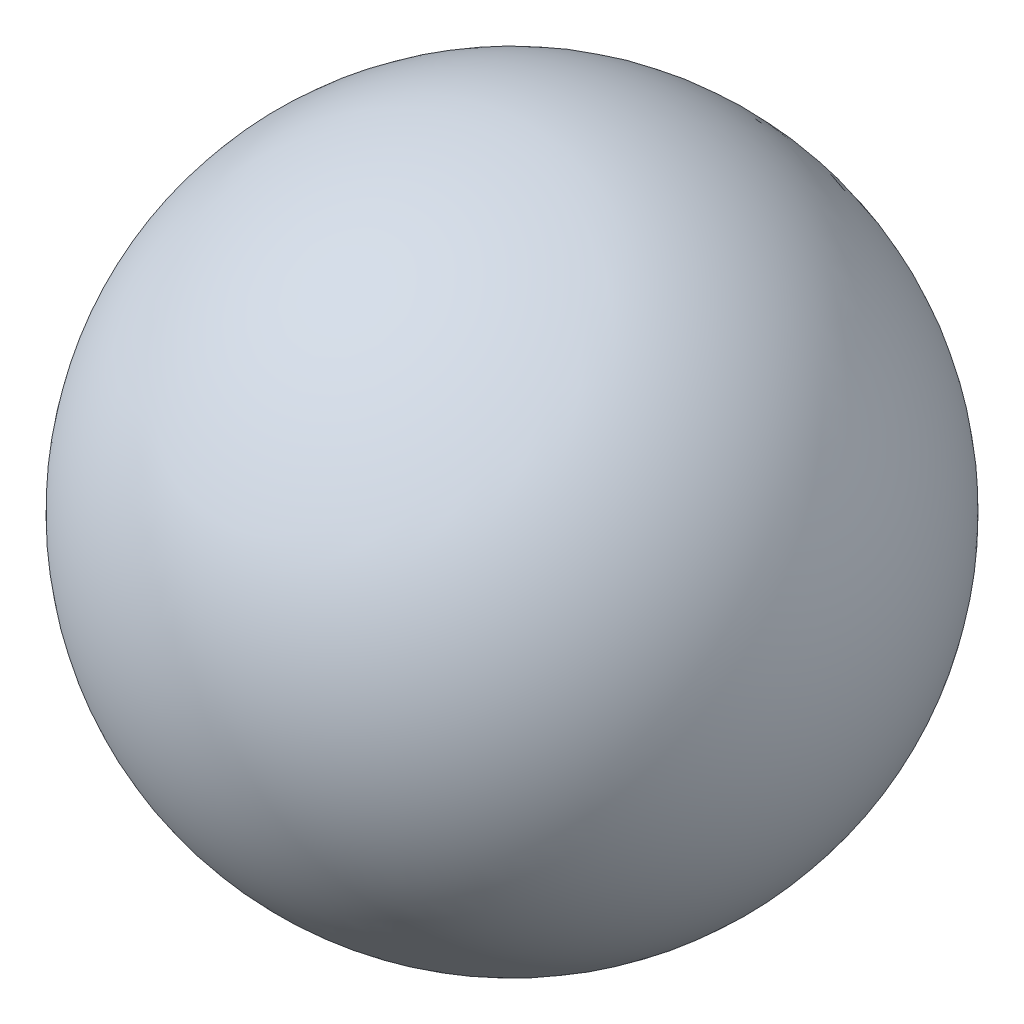
ISO-10303-21;
HEADER;
FILE_DESCRIPTION(('STEP AP214'),'2;1');
FILE_NAME('part.step','',(''),(''),'','','');
FILE_SCHEMA(('AUTOMOTIVE_DESIGN { 1 0 10303 214 1 1 1 1 }'));
ENDSEC;
DATA;
#1=APPLICATION_CONTEXT('core data for automotive mechanical design processes');
#2=APPLICATION_PROTOCOL_DEFINITION('international standard','automotive_design',2000,#1);
#3=PRODUCT_CONTEXT('',#1,'mechanical');
#4=PRODUCT('Part','Part','',(#3));
#5=PRODUCT_RELATED_PRODUCT_CATEGORY('part','',(#4));
#6=PRODUCT_DEFINITION_FORMATION('','',#4);
#7=PRODUCT_DEFINITION_CONTEXT('part definition',#1,'design');
#8=PRODUCT_DEFINITION('design','',#6,#7);
#9=PRODUCT_DEFINITION_SHAPE('','',#8);
#10=(LENGTH_UNIT() NAMED_UNIT(*) SI_UNIT(.MILLI.,.METRE.));
#11=(NAMED_UNIT(*) PLANE_ANGLE_UNIT() SI_UNIT($,.RADIAN.));
#12=(NAMED_UNIT(*) SI_UNIT($,.STERADIAN.) SOLID_ANGLE_UNIT());
#13=UNCERTAINTY_MEASURE_WITH_UNIT(LENGTH_MEASURE(1.E-05),#10,'distance_accuracy_value','');
#14=(GEOMETRIC_REPRESENTATION_CONTEXT(3) GLOBAL_UNCERTAINTY_ASSIGNED_CONTEXT((#13)) GLOBAL_UNIT_ASSIGNED_CONTEXT((#10,
#11,#12)) REPRESENTATION_CONTEXT('',''));
#15=CARTESIAN_POINT('',(0.,0.,0.));
#16=DIRECTION('',(0.,0.,1.));
#17=DIRECTION('',(1.,0.,0.));
#18=AXIS2_PLACEMENT_3D('',#15,#16,#17);
#19=CARTESIAN_POINT('',(64.16,-50.2923932754782,-47.7982831033149));
#20=DIRECTION('',(0.,-0.724851812050188,-0.68890481967218));
#21=DIRECTION('',(0.173648177666933,0.67843880750064,-0.713839684291973));
#22=AXIS2_PLACEMENT_3D('',#19,#20,#21);
#23=SPHERICAL_SURFACE('',#22,7.15);
#24=CARTESIAN_POINT('',(64.16,-45.1097028193194,-42.8726136426588));
#25=VERTEX_POINT('',#24);
#26=VERTEX_LOOP('',#25);
#27=FACE_BOUND('',#26,.T.);
#28=CARTESIAN_POINT('',(64.16,-55.475083731637,-52.723952563971));
#29=VERTEX_POINT('',#28);
#30=VERTEX_LOOP('',#29);
#31=FACE_BOUND('',#30,.T.);
#32=ADVANCED_FACE('F15',(#27,#31),#23,.T.);
#33=CLOSED_SHELL('',(#32));
#34=MANIFOLD_SOLID_BREP('B1',#33);
#35=ADVANCED_BREP_SHAPE_REPRESENTATION('',(#18,#34),#14);
#36=SHAPE_DEFINITION_REPRESENTATION(#9,#35);
ENDSEC;
END-ISO-10303-21;
